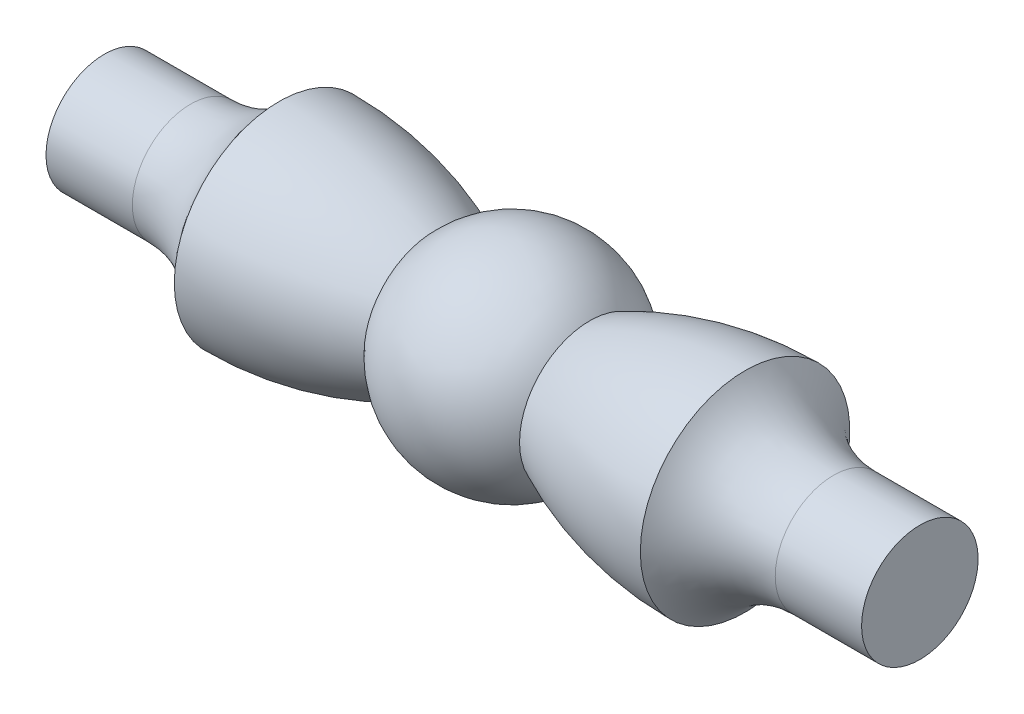
ISO-10303-21;
HEADER;
FILE_DESCRIPTION(('STEP AP214'),'2;1');
FILE_NAME('part.step','',(''),(''),'','','');
FILE_SCHEMA(('AUTOMOTIVE_DESIGN { 1 0 10303 214 1 1 1 1 }'));
ENDSEC;
DATA;
#1=APPLICATION_CONTEXT('core data for automotive mechanical design processes');
#2=APPLICATION_PROTOCOL_DEFINITION('international standard','automotive_design',2000,#1);
#3=PRODUCT_CONTEXT('',#1,'mechanical');
#4=PRODUCT('Part','Part','',(#3));
#5=PRODUCT_RELATED_PRODUCT_CATEGORY('part','',(#4));
#6=PRODUCT_DEFINITION_FORMATION('','',#4);
#7=PRODUCT_DEFINITION_CONTEXT('part definition',#1,'design');
#8=PRODUCT_DEFINITION('design','',#6,#7);
#9=PRODUCT_DEFINITION_SHAPE('','',#8);
#10=(LENGTH_UNIT() NAMED_UNIT(*) SI_UNIT(.MILLI.,.METRE.));
#11=(NAMED_UNIT(*) PLANE_ANGLE_UNIT() SI_UNIT($,.RADIAN.));
#12=(NAMED_UNIT(*) SI_UNIT($,.STERADIAN.) SOLID_ANGLE_UNIT());
#13=UNCERTAINTY_MEASURE_WITH_UNIT(LENGTH_MEASURE(1.E-05),#10,'distance_accuracy_value','');
#14=(GEOMETRIC_REPRESENTATION_CONTEXT(3) GLOBAL_UNCERTAINTY_ASSIGNED_CONTEXT((#13)) GLOBAL_UNIT_ASSIGNED_CONTEXT((#10,
#11,#12)) REPRESENTATION_CONTEXT('',''));
#15=CARTESIAN_POINT('',(0.,0.,0.));
#16=DIRECTION('',(0.,0.,1.));
#17=DIRECTION('',(1.,0.,0.));
#18=AXIS2_PLACEMENT_3D('',#15,#16,#17);
#19=CARTESIAN_POINT('',(-7.,0.,0.));
#20=DIRECTION('',(1.,0.,0.));
#21=DIRECTION('',(0.,0.,-1.));
#22=AXIS2_PLACEMENT_3D('',#19,#20,#21);
#23=PLANE('',#22);
#24=CARTESIAN_POINT('',(-7.,0.,0.));
#25=DIRECTION('',(-1.,0.,0.));
#26=DIRECTION('',(0.,0.,1.));
#27=AXIS2_PLACEMENT_3D('',#24,#25,#26);
#28=CIRCLE('',#27,1.);
#29=CARTESIAN_POINT('',(-7.,0.,1.));
#30=VERTEX_POINT('',#29);
#31=EDGE_CURVE('E10',#30,#30,#28,.T.);
#32=ORIENTED_EDGE('',*,*,#31,.T.);
#33=EDGE_LOOP('',(#32));
#34=FACE_BOUND('',#33,.T.);
#35=ADVANCED_FACE('F35',(#34),#23,.F.);
#36=CARTESIAN_POINT('',(-7.,0.,0.));
#37=DIRECTION('',(-1.,0.,0.));
#38=DIRECTION('',(0.,0.,1.));
#39=AXIS2_PLACEMENT_3D('',#36,#37,#38);
#40=CYLINDRICAL_SURFACE('',#39,1.);
#41=ORIENTED_EDGE('',*,*,#31,.F.);
#42=EDGE_LOOP('',(#41));
#43=FACE_BOUND('',#42,.T.);
#44=CARTESIAN_POINT('',(-5.51771325029981,0.,0.));
#45=DIRECTION('',(-1.,0.,0.));
#46=DIRECTION('',(0.,0.,1.));
#47=AXIS2_PLACEMENT_3D('',#44,#45,#46);
#48=CIRCLE('',#47,1.);
#49=CARTESIAN_POINT('',(-5.51771325029981,0.,1.));
#50=VERTEX_POINT('',#49);
#51=EDGE_CURVE('E41',#50,#50,#48,.T.);
#52=ORIENTED_EDGE('',*,*,#51,.T.);
#53=EDGE_LOOP('',(#52));
#54=FACE_BOUND('',#53,.T.);
#55=ADVANCED_FACE('F79',(#43,#54),#40,.T.);
#56=CARTESIAN_POINT('',(-5.51771325029981,0.,0.));
#57=DIRECTION('',(-1.,0.,0.));
#58=DIRECTION('',(0.,0.,1.));
#59=AXIS2_PLACEMENT_3D('',#56,#57,#58);
#60=TOROIDAL_SURFACE('',#59,2.84231532016239,1.84231532016238);
#61=ORIENTED_EDGE('',*,*,#51,.F.);
#62=EDGE_LOOP('',(#61));
#63=FACE_BOUND('',#62,.T.);
#64=CARTESIAN_POINT('',(-4.,0.,0.));
#65=DIRECTION('',(-1.,0.,0.));
#66=DIRECTION('',(0.,0.,1.));
#67=AXIS2_PLACEMENT_3D('',#64,#65,#66);
#68=CIRCLE('',#67,1.7979627797004);
#69=CARTESIAN_POINT('',(-4.,0.,1.7979627797004));
#70=VERTEX_POINT('',#69);
#71=EDGE_CURVE('E45',#70,#70,#68,.T.);
#72=ORIENTED_EDGE('',*,*,#71,.T.);
#73=EDGE_LOOP('',(#72));
#74=FACE_BOUND('',#73,.T.);
#75=ADVANCED_FACE('F83',(#63,#74),#60,.F.);
#76=CARTESIAN_POINT('',(-4.,0.,0.));
#77=DIRECTION('',(-1.,0.,0.));
#78=DIRECTION('',(0.,0.,1.));
#79=AXIS2_PLACEMENT_3D('',#76,#77,#78);
#80=DEGENERATE_TOROIDAL_SURFACE('',#79,4.4955803074862,6.2935430871866,.F.);
#81=ORIENTED_EDGE('',*,*,#71,.F.);
#82=EDGE_LOOP('',(#81));
#83=FACE_BOUND('',#82,.T.);
#84=CARTESIAN_POINT('',(-1.3340356008409,0.,0.));
#85=DIRECTION('',(-1.,0.,0.));
#86=DIRECTION('',(0.,0.,1.));
#87=AXIS2_PLACEMENT_3D('',#84,#85,#86);
#88=CIRCLE('',#87,1.2054124492791);
#89=CARTESIAN_POINT('',(-1.3340356008409,0.,1.2054124492791));
#90=VERTEX_POINT('',#89);
#91=EDGE_CURVE('E49',#90,#90,#88,.T.);
#92=ORIENTED_EDGE('',*,*,#91,.T.);
#93=EDGE_LOOP('',(#92));
#94=FACE_BOUND('',#93,.T.);
#95=ADVANCED_FACE('F88',(#83,#94),#80,.F.);
#96=CARTESIAN_POINT('',(0.,0.,0.));
#97=DIRECTION('',(-1.,0.,0.));
#98=DIRECTION('',(0.,1.,0.));
#99=AXIS2_PLACEMENT_3D('',#96,#97,#98);
#100=SPHERICAL_SURFACE('',#99,1.7979627797004);
#101=ORIENTED_EDGE('',*,*,#91,.F.);
#102=EDGE_LOOP('',(#101));
#103=FACE_BOUND('',#102,.T.);
#104=CARTESIAN_POINT('',(1.3340356008409,0.,0.));
#105=DIRECTION('',(-1.,0.,0.));
#106=DIRECTION('',(0.,0.,1.));
#107=AXIS2_PLACEMENT_3D('',#104,#105,#106);
#108=CIRCLE('',#107,1.2054124492791);
#109=CARTESIAN_POINT('',(1.3340356008409,0.,1.2054124492791));
#110=VERTEX_POINT('',#109);
#111=EDGE_CURVE('E54',#110,#110,#108,.T.);
#112=ORIENTED_EDGE('',*,*,#111,.T.);
#113=EDGE_LOOP('',(#112));
#114=FACE_BOUND('',#113,.T.);
#115=ADVANCED_FACE('F94',(#103,#114),#100,.T.);
#116=CARTESIAN_POINT('',(4.,0.,0.));
#117=DIRECTION('',(-1.,0.,0.));
#118=DIRECTION('',(0.,0.,1.));
#119=AXIS2_PLACEMENT_3D('',#116,#117,#118);
#120=DEGENERATE_TOROIDAL_SURFACE('',#119,4.4955803074862,6.2935430871866,.F.);
#121=ORIENTED_EDGE('',*,*,#111,.F.);
#122=EDGE_LOOP('',(#121));
#123=FACE_BOUND('',#122,.T.);
#124=CARTESIAN_POINT('',(4.,0.,0.));
#125=DIRECTION('',(-1.,0.,0.));
#126=DIRECTION('',(0.,0.,1.));
#127=AXIS2_PLACEMENT_3D('',#124,#125,#126);
#128=CIRCLE('',#127,1.7979627797004);
#129=CARTESIAN_POINT('',(4.,0.,1.7979627797004));
#130=VERTEX_POINT('',#129);
#131=EDGE_CURVE('E57',#130,#130,#128,.T.);
#132=ORIENTED_EDGE('',*,*,#131,.T.);
#133=EDGE_LOOP('',(#132));
#134=FACE_BOUND('',#133,.T.);
#135=ADVANCED_FACE('F98',(#123,#134),#120,.F.);
#136=CARTESIAN_POINT('',(5.51771325029981,0.,0.));
#137=DIRECTION('',(-1.,0.,0.));
#138=DIRECTION('',(0.,0.,1.));
#139=AXIS2_PLACEMENT_3D('',#136,#137,#138);
#140=TOROIDAL_SURFACE('',#139,2.84231532016239,1.84231532016238);
#141=ORIENTED_EDGE('',*,*,#131,.F.);
#142=EDGE_LOOP('',(#141));
#143=FACE_BOUND('',#142,.T.);
#144=CARTESIAN_POINT('',(5.51771325029981,0.,0.));
#145=DIRECTION('',(-1.,0.,0.));
#146=DIRECTION('',(0.,0.,1.));
#147=AXIS2_PLACEMENT_3D('',#144,#145,#146);
#148=CIRCLE('',#147,1.);
#149=CARTESIAN_POINT('',(5.51771325029981,0.,1.));
#150=VERTEX_POINT('',#149);
#151=EDGE_CURVE('E60',#150,#150,#148,.T.);
#152=ORIENTED_EDGE('',*,*,#151,.T.);
#153=EDGE_LOOP('',(#152));
#154=FACE_BOUND('',#153,.T.);
#155=ADVANCED_FACE('F75',(#143,#154),#140,.F.);
#156=CARTESIAN_POINT('',(-7.,0.,0.));
#157=DIRECTION('',(-1.,0.,0.));
#158=DIRECTION('',(0.,0.,1.));
#159=AXIS2_PLACEMENT_3D('',#156,#157,#158);
#160=CYLINDRICAL_SURFACE('',#159,1.);
#161=ORIENTED_EDGE('',*,*,#151,.F.);
#162=EDGE_LOOP('',(#161));
#163=FACE_BOUND('',#162,.T.);
#164=CARTESIAN_POINT('',(7.,0.,0.));
#165=DIRECTION('',(-1.,0.,0.));
#166=DIRECTION('',(0.,0.,1.));
#167=AXIS2_PLACEMENT_3D('',#164,#165,#166);
#168=CIRCLE('',#167,1.);
#169=CARTESIAN_POINT('',(7.,0.,1.));
#170=VERTEX_POINT('',#169);
#171=EDGE_CURVE('E63',#170,#170,#168,.T.);
#172=ORIENTED_EDGE('',*,*,#171,.T.);
#173=EDGE_LOOP('',(#172));
#174=FACE_BOUND('',#173,.T.);
#175=ADVANCED_FACE('F67',(#163,#174),#160,.T.);
#176=CARTESIAN_POINT('',(7.,0.,0.));
#177=DIRECTION('',(-1.,0.,0.));
#178=DIRECTION('',(0.,0.,1.));
#179=AXIS2_PLACEMENT_3D('',#176,#177,#178);
#180=PLANE('',#179);
#181=ORIENTED_EDGE('',*,*,#171,.F.);
#182=EDGE_LOOP('',(#181));
#183=FACE_BOUND('',#182,.T.);
#184=ADVANCED_FACE('F69',(#183),#180,.F.);
#185=CLOSED_SHELL('',(#35,#55,#75,#95,#115,#135,#155,#175,#184));
#186=MANIFOLD_SOLID_BREP('B2',#185);
#187=ADVANCED_BREP_SHAPE_REPRESENTATION('',(#18,#186),#14);
#188=SHAPE_DEFINITION_REPRESENTATION(#9,#187);
ENDSEC;
END-ISO-10303-21;
